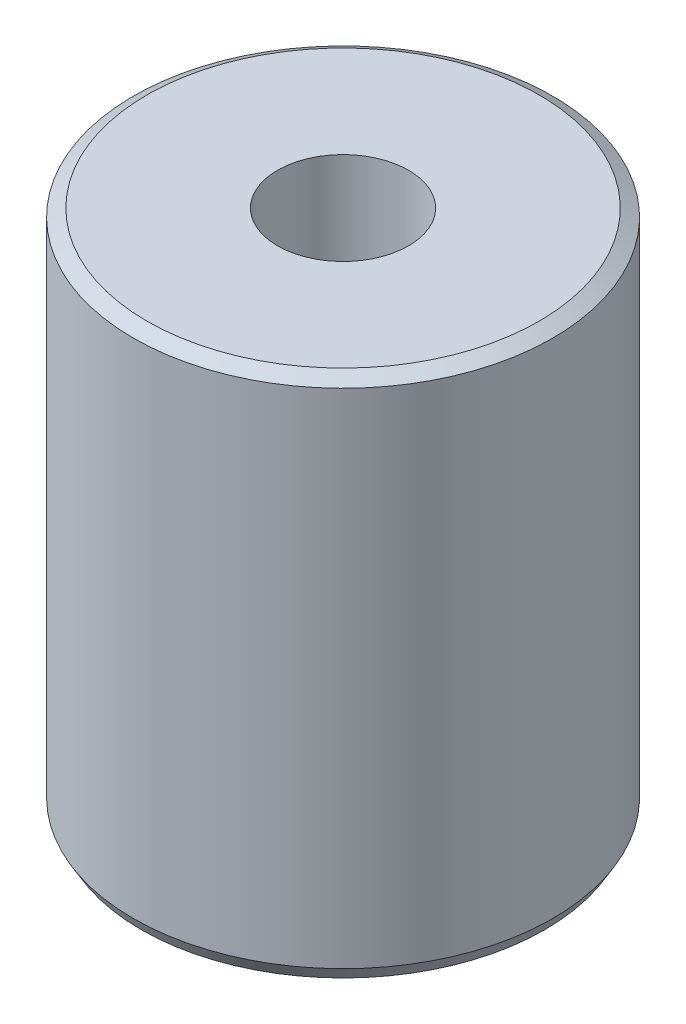
ISO-10303-21;
HEADER;
FILE_DESCRIPTION(('STEP AP214'),'2;1');
FILE_NAME('part.step','',(''),(''),'','','');
FILE_SCHEMA(('AUTOMOTIVE_DESIGN { 1 0 10303 214 1 1 1 1 }'));
ENDSEC;
DATA;
#1=APPLICATION_CONTEXT('core data for automotive mechanical design processes');
#2=APPLICATION_PROTOCOL_DEFINITION('international standard','automotive_design',2000,#1);
#3=PRODUCT_CONTEXT('',#1,'mechanical');
#4=PRODUCT('Part','Part','',(#3));
#5=PRODUCT_RELATED_PRODUCT_CATEGORY('part','',(#4));
#6=PRODUCT_DEFINITION_FORMATION('','',#4);
#7=PRODUCT_DEFINITION_CONTEXT('part definition',#1,'design');
#8=PRODUCT_DEFINITION('design','',#6,#7);
#9=PRODUCT_DEFINITION_SHAPE('','',#8);
#10=(LENGTH_UNIT() NAMED_UNIT(*) SI_UNIT(.MILLI.,.METRE.));
#11=(NAMED_UNIT(*) PLANE_ANGLE_UNIT() SI_UNIT($,.RADIAN.));
#12=(NAMED_UNIT(*) SI_UNIT($,.STERADIAN.) SOLID_ANGLE_UNIT());
#13=UNCERTAINTY_MEASURE_WITH_UNIT(LENGTH_MEASURE(1.E-05),#10,'distance_accuracy_value','');
#14=(GEOMETRIC_REPRESENTATION_CONTEXT(3) GLOBAL_UNCERTAINTY_ASSIGNED_CONTEXT((#13)) GLOBAL_UNIT_ASSIGNED_CONTEXT((#10,
#11,#12)) REPRESENTATION_CONTEXT('',''));
#15=CARTESIAN_POINT('',(0.,0.,0.));
#16=DIRECTION('',(0.,0.,1.));
#17=DIRECTION('',(1.,0.,0.));
#18=AXIS2_PLACEMENT_3D('',#15,#16,#17);
#19=CARTESIAN_POINT('',(0.,10.,0.));
#20=DIRECTION('',(0.,-1.,0.));
#21=DIRECTION('',(0.,0.,-1.));
#22=AXIS2_PLACEMENT_3D('',#19,#20,#21);
#23=CYLINDRICAL_SURFACE('',#22,4.);
#24=CARTESIAN_POINT('',(0.,0.259807621135326,0.));
#25=DIRECTION('',(0.,1.,0.));
#26=DIRECTION('',(0.,0.,1.));
#27=AXIS2_PLACEMENT_3D('',#24,#25,#26);
#28=CIRCLE('',#27,4.);
#29=CARTESIAN_POINT('',(0.,0.259807621135326,4.));
#30=VERTEX_POINT('',#29);
#31=EDGE_CURVE('E49',#30,#30,#28,.T.);
#32=ORIENTED_EDGE('',*,*,#31,.T.);
#33=EDGE_LOOP('',(#32));
#34=FACE_BOUND('',#33,.T.);
#35=CARTESIAN_POINT('',(0.,9.85,0.));
#36=DIRECTION('',(0.,1.,0.));
#37=DIRECTION('',(0.,0.,1.));
#38=AXIS2_PLACEMENT_3D('',#35,#36,#37);
#39=CIRCLE('',#38,4.);
#40=CARTESIAN_POINT('',(0.,9.85,4.));
#41=VERTEX_POINT('',#40);
#42=EDGE_CURVE('E53',#41,#41,#39,.F.);
#43=ORIENTED_EDGE('',*,*,#42,.T.);
#44=EDGE_LOOP('',(#43));
#45=FACE_BOUND('',#44,.T.);
#46=ADVANCED_FACE('F37',(#34,#45),#23,.T.);
#47=CARTESIAN_POINT('',(0.,10.,0.));
#48=DIRECTION('',(0.,1.,0.));
#49=DIRECTION('',(0.,0.,1.));
#50=AXIS2_PLACEMENT_3D('',#47,#48,#49);
#51=PLANE('',#50);
#52=CARTESIAN_POINT('',(0.,10.,0.));
#53=DIRECTION('',(0.,1.,0.));
#54=DIRECTION('',(0.,0.,1.));
#55=AXIS2_PLACEMENT_3D('',#52,#53,#54);
#56=CIRCLE('',#55,1.24999999999999);
#57=CARTESIAN_POINT('',(0.,10.,1.24999999999999));
#58=VERTEX_POINT('',#57);
#59=EDGE_CURVE('E61',#58,#58,#56,.T.);
#60=ORIENTED_EDGE('',*,*,#59,.F.);
#61=EDGE_LOOP('',(#60));
#62=FACE_BOUND('',#61,.T.);
#63=CARTESIAN_POINT('',(0.,10.,0.));
#64=DIRECTION('',(0.,1.,0.));
#65=DIRECTION('',(0.,0.,1.));
#66=AXIS2_PLACEMENT_3D('',#63,#64,#65);
#67=CIRCLE('',#66,3.74019237886466);
#68=CARTESIAN_POINT('',(0.,10.,3.74019237886466));
#69=VERTEX_POINT('',#68);
#70=EDGE_CURVE('E10',#69,#69,#67,.T.);
#71=ORIENTED_EDGE('',*,*,#70,.T.);
#72=EDGE_LOOP('',(#71));
#73=FACE_BOUND('',#72,.T.);
#74=ADVANCED_FACE('F67',(#62,#73),#51,.T.);
#75=CARTESIAN_POINT('',(0.,0.,0.));
#76=DIRECTION('',(0.,1.,0.));
#77=DIRECTION('',(0.,0.,1.));
#78=AXIS2_PLACEMENT_3D('',#75,#76,#77);
#79=PLANE('',#78);
#80=CARTESIAN_POINT('',(0.,0.,0.));
#81=DIRECTION('',(0.,1.,0.));
#82=DIRECTION('',(0.,0.,1.));
#83=AXIS2_PLACEMENT_3D('',#80,#81,#82);
#84=CIRCLE('',#83,1.24999999999999);
#85=CARTESIAN_POINT('',(0.,0.,1.24999999999999));
#86=VERTEX_POINT('',#85);
#87=EDGE_CURVE('E58',#86,#86,#84,.T.);
#88=ORIENTED_EDGE('',*,*,#87,.T.);
#89=EDGE_LOOP('',(#88));
#90=FACE_BOUND('',#89,.T.);
#91=CARTESIAN_POINT('',(0.,0.,0.));
#92=DIRECTION('',(0.,1.,0.));
#93=DIRECTION('',(0.,0.,1.));
#94=AXIS2_PLACEMENT_3D('',#91,#92,#93);
#95=CIRCLE('',#94,3.85);
#96=CARTESIAN_POINT('',(0.,0.,3.85));
#97=VERTEX_POINT('',#96);
#98=EDGE_CURVE('E45',#97,#97,#95,.F.);
#99=ORIENTED_EDGE('',*,*,#98,.T.);
#100=EDGE_LOOP('',(#99));
#101=FACE_BOUND('',#100,.T.);
#102=ADVANCED_FACE('F69',(#90,#101),#79,.F.);
#103=CARTESIAN_POINT('',(0.,0.259807621135326,0.));
#104=DIRECTION('',(0.,1.,0.));
#105=DIRECTION('',(0.,0.,1.));
#106=AXIS2_PLACEMENT_3D('',#103,#104,#105);
#107=CONICAL_SURFACE('',#106,4.,0.523598775598303);
#108=ORIENTED_EDGE('',*,*,#98,.F.);
#109=EDGE_LOOP('',(#108));
#110=FACE_BOUND('',#109,.T.);
#111=ORIENTED_EDGE('',*,*,#31,.F.);
#112=EDGE_LOOP('',(#111));
#113=FACE_BOUND('',#112,.T.);
#114=ADVANCED_FACE('F75',(#110,#113),#107,.T.);
#115=CARTESIAN_POINT('',(0.,10.,0.));
#116=DIRECTION('',(0.,-1.,0.));
#117=DIRECTION('',(0.,0.,-1.));
#118=AXIS2_PLACEMENT_3D('',#115,#116,#117);
#119=CONICAL_SURFACE('',#118,3.74019237886466,1.0471975511966);
#120=ORIENTED_EDGE('',*,*,#42,.F.);
#121=EDGE_LOOP('',(#120));
#122=FACE_BOUND('',#121,.T.);
#123=ORIENTED_EDGE('',*,*,#70,.F.);
#124=EDGE_LOOP('',(#123));
#125=FACE_BOUND('',#124,.T.);
#126=ADVANCED_FACE('F40',(#122,#125),#119,.T.);
#127=CARTESIAN_POINT('',(0.,10.,0.));
#128=DIRECTION('',(0.,1.,0.));
#129=DIRECTION('',(0.,0.,1.));
#130=AXIS2_PLACEMENT_3D('',#127,#128,#129);
#131=CYLINDRICAL_SURFACE('',#130,1.24999999999999);
#132=ORIENTED_EDGE('',*,*,#87,.F.);
#133=EDGE_LOOP('',(#132));
#134=FACE_BOUND('',#133,.T.);
#135=ORIENTED_EDGE('',*,*,#59,.T.);
#136=EDGE_LOOP('',(#135));
#137=FACE_BOUND('',#136,.T.);
#138=ADVANCED_FACE('F65',(#134,#137),#131,.F.);
#139=CLOSED_SHELL('',(#46,#74,#102,#114,#126,#138));
#140=MANIFOLD_SOLID_BREP('B2',#139);
#141=ADVANCED_BREP_SHAPE_REPRESENTATION('',(#18,#140),#14);
#142=SHAPE_DEFINITION_REPRESENTATION(#9,#141);
ENDSEC;
END-ISO-10303-21;
